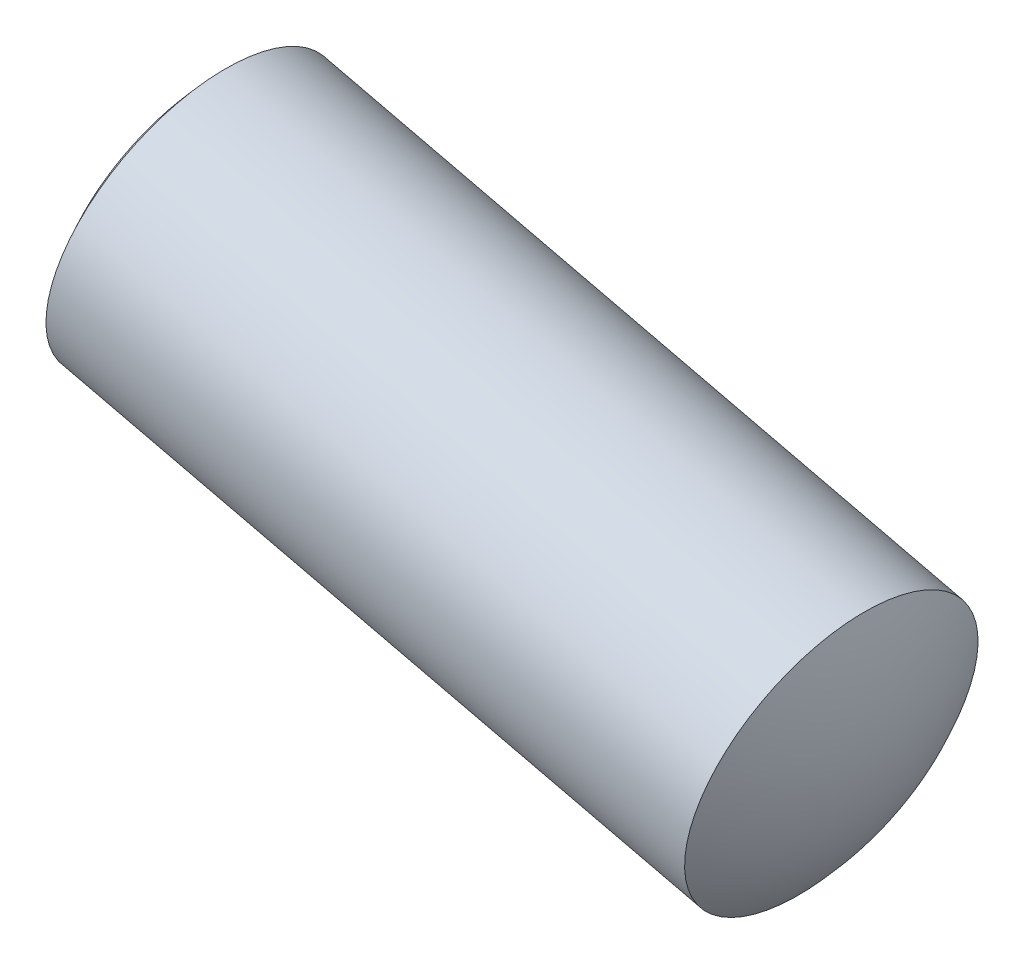
ISO-10303-21;
HEADER;
FILE_DESCRIPTION(('STEP AP214'),'2;1');
FILE_NAME('part.step','',(''),(''),'','','');
FILE_SCHEMA(('AUTOMOTIVE_DESIGN { 1 0 10303 214 1 1 1 1 }'));
ENDSEC;
DATA;
#1=APPLICATION_CONTEXT('core data for automotive mechanical design processes');
#2=APPLICATION_PROTOCOL_DEFINITION('international standard','automotive_design',2000,#1);
#3=PRODUCT_CONTEXT('',#1,'mechanical');
#4=PRODUCT('Part','Part','',(#3));
#5=PRODUCT_RELATED_PRODUCT_CATEGORY('part','',(#4));
#6=PRODUCT_DEFINITION_FORMATION('','',#4);
#7=PRODUCT_DEFINITION_CONTEXT('part definition',#1,'design');
#8=PRODUCT_DEFINITION('design','',#6,#7);
#9=PRODUCT_DEFINITION_SHAPE('','',#8);
#10=(LENGTH_UNIT() NAMED_UNIT(*) SI_UNIT(.MILLI.,.METRE.));
#11=(NAMED_UNIT(*) PLANE_ANGLE_UNIT() SI_UNIT($,.RADIAN.));
#12=(NAMED_UNIT(*) SI_UNIT($,.STERADIAN.) SOLID_ANGLE_UNIT());
#13=UNCERTAINTY_MEASURE_WITH_UNIT(LENGTH_MEASURE(1.E-05),#10,'distance_accuracy_value','');
#14=(GEOMETRIC_REPRESENTATION_CONTEXT(3) GLOBAL_UNCERTAINTY_ASSIGNED_CONTEXT((#13)) GLOBAL_UNIT_ASSIGNED_CONTEXT((#10,
#11,#12)) REPRESENTATION_CONTEXT('',''));
#15=CARTESIAN_POINT('',(0.,0.,0.));
#16=DIRECTION('',(0.,0.,1.));
#17=DIRECTION('',(1.,0.,0.));
#18=AXIS2_PLACEMENT_3D('',#15,#16,#17);
#19=CARTESIAN_POINT('',(21.7121843104581,-5.14283522317305,0.6));
#20=DIRECTION('',(-0.23048657435735,-0.973075505313444,0.));
#21=DIRECTION('',(0.973075505313444,-0.230486574357351,0.));
#22=AXIS2_PLACEMENT_3D('',#19,#20,#21);
#23=SPHERICAL_SURFACE('',#22,2.);
#24=CARTESIAN_POINT('',(21.7121843104581,-5.14283522317305,0.6));
#25=DIRECTION('',(-0.973075505313444,0.23048657435735,0.));
#26=DIRECTION('',(0.,0.,-1.));
#27=AXIS2_PLACEMENT_3D('',#24,#25,#26);
#28=SPHERICAL_SURFACE('',#27,2.);
#29=CARTESIAN_POINT('',(23.3976005252618,-5.54204968042249,0.6));
#30=DIRECTION('',(-0.973075505313444,0.23048657435735,0.));
#31=DIRECTION('',(0.,0.,-1.));
#32=AXIS2_PLACEMENT_3D('',#29,#30,#31);
#33=CIRCLE('',#32,1.);
#34=CARTESIAN_POINT('',(23.3976005252618,-5.54204968042249,-0.4));
#35=VERTEX_POINT('',#34);
#36=EDGE_CURVE('E11',#35,#35,#33,.T.);
#37=ORIENTED_EDGE('',*,*,#36,.F.);
#38=EDGE_LOOP('',(#37));
#39=FACE_BOUND('',#38,.T.);
#40=ADVANCED_FACE('F17',(#39),#28,.T.);
#41=CARTESIAN_POINT('',(20.6166001706766,-4.88333076137171,0.6));
#42=DIRECTION('',(-0.23048657435735,-0.973075505313444,0.));
#43=DIRECTION('',(-0.973075505313444,0.230486574357351,0.));
#44=AXIS2_PLACEMENT_3D('',#41,#42,#43);
#45=SPHERICAL_SURFACE('',#44,2.);
#46=CARTESIAN_POINT('',(20.6166001706766,-4.88333076137171,0.6));
#47=DIRECTION('',(-0.973075505313444,0.23048657435735,0.));
#48=DIRECTION('',(0.,0.,-1.));
#49=AXIS2_PLACEMENT_3D('',#46,#47,#48);
#50=SPHERICAL_SURFACE('',#49,2.);
#51=CARTESIAN_POINT('',(18.931183955873,-4.48411630412227,0.6));
#52=DIRECTION('',(-0.973075505313444,0.23048657435735,0.));
#53=DIRECTION('',(0.,0.,-1.));
#54=AXIS2_PLACEMENT_3D('',#51,#52,#53);
#55=CIRCLE('',#54,1.);
#56=CARTESIAN_POINT('',(18.931183955873,-4.48411630412227,-0.4));
#57=VERTEX_POINT('',#56);
#58=EDGE_CURVE('E21',#57,#57,#55,.T.);
#59=ORIENTED_EDGE('',*,*,#58,.T.);
#60=EDGE_LOOP('',(#59));
#61=FACE_BOUND('',#60,.T.);
#62=ADVANCED_FACE('F40',(#61),#50,.T.);
#63=CARTESIAN_POINT('',(20.0477880982202,-4.74859964819729,0.6));
#64=DIRECTION('',(-0.973075505313444,0.23048657435735,0.));
#65=DIRECTION('',(0.,0.,-1.));
#66=AXIS2_PLACEMENT_3D('',#63,#64,#65);
#67=CYLINDRICAL_SURFACE('',#66,1.);
#68=ORIENTED_EDGE('',*,*,#36,.T.);
#69=EDGE_LOOP('',(#68));
#70=FACE_BOUND('',#69,.T.);
#71=ORIENTED_EDGE('',*,*,#58,.F.);
#72=EDGE_LOOP('',(#71));
#73=FACE_BOUND('',#72,.T.);
#74=ADVANCED_FACE('F19',(#70,#73),#67,.T.);
#75=CLOSED_SHELL('',(#40,#62,#74));
#76=MANIFOLD_SOLID_BREP('B1',#75);
#77=ADVANCED_BREP_SHAPE_REPRESENTATION('',(#18,#76),#14);
#78=SHAPE_DEFINITION_REPRESENTATION(#9,#77);
ENDSEC;
END-ISO-10303-21;
